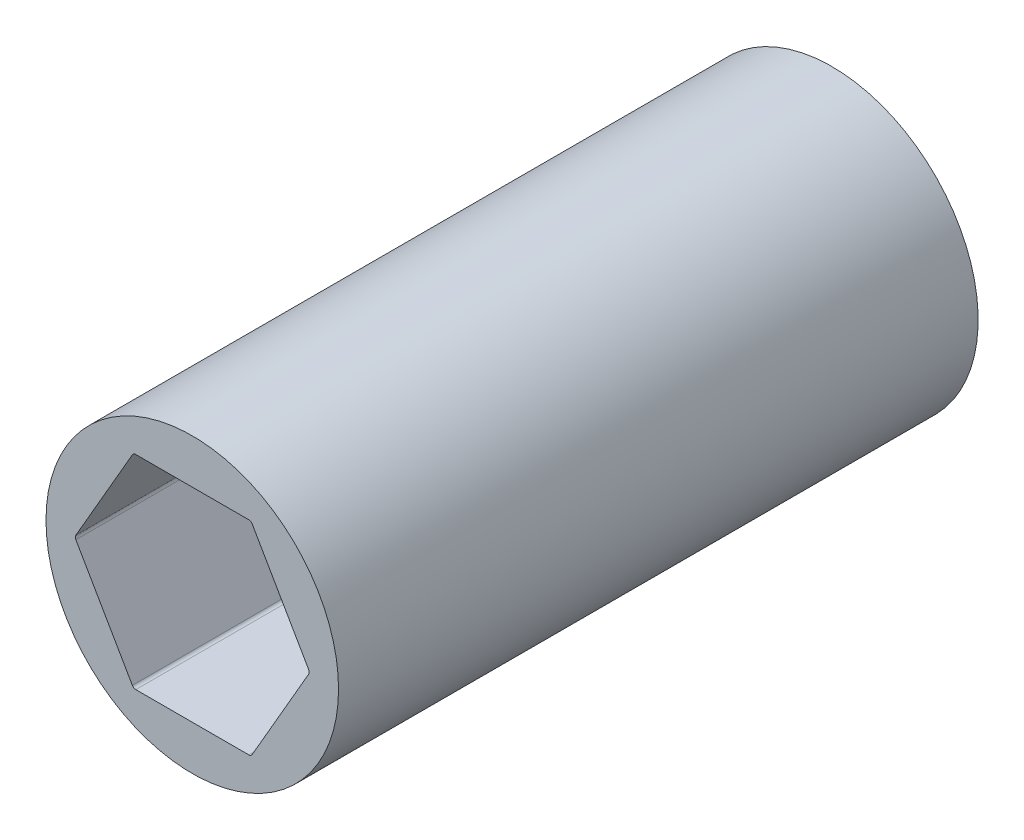
ISO-10303-21;
HEADER;
FILE_DESCRIPTION(('STEP AP214'),'2;1');
FILE_NAME('part.step','',(''),(''),'','','');
FILE_SCHEMA(('AUTOMOTIVE_DESIGN { 1 0 10303 214 1 1 1 1 }'));
ENDSEC;
DATA;
#1=APPLICATION_CONTEXT('core data for automotive mechanical design processes');
#2=APPLICATION_PROTOCOL_DEFINITION('international standard','automotive_design',2000,#1);
#3=PRODUCT_CONTEXT('',#1,'mechanical');
#4=PRODUCT('Part','Part','',(#3));
#5=PRODUCT_RELATED_PRODUCT_CATEGORY('part','',(#4));
#6=PRODUCT_DEFINITION_FORMATION('','',#4);
#7=PRODUCT_DEFINITION_CONTEXT('part definition',#1,'design');
#8=PRODUCT_DEFINITION('design','',#6,#7);
#9=PRODUCT_DEFINITION_SHAPE('','',#8);
#10=(LENGTH_UNIT() NAMED_UNIT(*) SI_UNIT(.MILLI.,.METRE.));
#11=(NAMED_UNIT(*) PLANE_ANGLE_UNIT() SI_UNIT($,.RADIAN.));
#12=(NAMED_UNIT(*) SI_UNIT($,.STERADIAN.) SOLID_ANGLE_UNIT());
#13=UNCERTAINTY_MEASURE_WITH_UNIT(LENGTH_MEASURE(1.E-05),#10,'distance_accuracy_value','');
#14=(GEOMETRIC_REPRESENTATION_CONTEXT(3) GLOBAL_UNCERTAINTY_ASSIGNED_CONTEXT((#13)) GLOBAL_UNIT_ASSIGNED_CONTEXT((#10,
#11,#12)) REPRESENTATION_CONTEXT('',''));
#15=CARTESIAN_POINT('',(0.,0.,0.));
#16=DIRECTION('',(0.,0.,1.));
#17=DIRECTION('',(1.,0.,0.));
#18=AXIS2_PLACEMENT_3D('',#15,#16,#17);
#19=CARTESIAN_POINT('',(7.25902493452117,0.,30.48));
#20=DIRECTION('',(0.,0.,1.));
#21=DIRECTION('',(1.,0.,0.));
#22=AXIS2_PLACEMENT_3D('',#19,#20,#21);
#23=CYLINDRICAL_SURFACE('',#22,0.254);
#24=DIRECTION('',(0.,0.,1.));
#25=VECTOR('',#24,1.);
#26=CARTESIAN_POINT('',(7.47899538708242,0.127,30.48));
#27=LINE('',#26,#25);
#28=CARTESIAN_POINT('',(7.47899538708242,0.127,-10.61466));
#29=VERTEX_POINT('',#28);
#30=CARTESIAN_POINT('',(7.47899538708242,0.127,30.48));
#31=VERTEX_POINT('',#30);
#32=EDGE_CURVE('E233',#29,#31,#27,.T.);
#33=ORIENTED_EDGE('',*,*,#32,.F.);
#34=CARTESIAN_POINT('',(7.25902493452117,0.,-10.61466));
#35=DIRECTION('',(0.,0.,-1.));
#36=DIRECTION('',(-1.,0.,0.));
#37=AXIS2_PLACEMENT_3D('',#34,#35,#36);
#38=CIRCLE('',#37,0.254000000000002);
#39=CARTESIAN_POINT('',(7.47899538708242,-0.127,-10.61466));
#40=VERTEX_POINT('',#39);
#41=EDGE_CURVE('E329',#29,#40,#38,.T.);
#42=ORIENTED_EDGE('',*,*,#41,.T.);
#43=DIRECTION('',(0.,0.,-1.));
#44=VECTOR('',#43,1.);
#45=CARTESIAN_POINT('',(7.47899538708242,-0.127,0.));
#46=LINE('',#45,#44);
#47=CARTESIAN_POINT('',(7.47899538708242,-0.127000000000001,30.48));
#48=VERTEX_POINT('',#47);
#49=EDGE_CURVE('E196',#48,#40,#46,.T.);
#50=ORIENTED_EDGE('',*,*,#49,.F.);
#51=CARTESIAN_POINT('',(7.25902493452117,0.,30.48));
#52=DIRECTION('',(0.,0.,-1.));
#53=DIRECTION('',(1.,0.,0.));
#54=AXIS2_PLACEMENT_3D('',#51,#52,#53);
#55=CIRCLE('',#54,0.254);
#56=CARTESIAN_POINT('',(7.51302493452117,0.,30.48));
#57=VERTEX_POINT('',#56);
#58=EDGE_CURVE('E164',#57,#48,#55,.T.);
#59=ORIENTED_EDGE('',*,*,#58,.F.);
#60=DIRECTION('',(0.,0.,1.));
#61=VECTOR('',#60,1.);
#62=CARTESIAN_POINT('',(7.51302493452117,0.,30.48));
#63=LINE('',#62,#61);
#64=CARTESIAN_POINT('',(7.51302493452117,0.,0.));
#65=VERTEX_POINT('',#64);
#66=EDGE_CURVE('E11',#65,#57,#63,.T.);
#67=ORIENTED_EDGE('',*,*,#66,.F.);
#68=ORIENTED_EDGE('',*,*,#66,.T.);
#69=CARTESIAN_POINT('',(7.25902493452117,0.,30.48));
#70=DIRECTION('',(0.,0.,-1.));
#71=DIRECTION('',(1.,0.,0.));
#72=AXIS2_PLACEMENT_3D('',#69,#70,#71);
#73=CIRCLE('',#72,0.254);
#74=EDGE_CURVE('E221',#31,#57,#73,.T.);
#75=ORIENTED_EDGE('',*,*,#74,.F.);
#76=EDGE_LOOP('',(#33,#42,#50,#59,#67,#68,#75));
#77=FACE_BOUND('',#76,.T.);
#78=ADVANCED_FACE('F43',(#77),#23,.F.);
#79=CARTESIAN_POINT('',(0.,0.,30.48));
#80=DIRECTION('',(0.,0.,-1.));
#81=DIRECTION('',(-1.,0.,0.));
#82=AXIS2_PLACEMENT_3D('',#79,#80,#81);
#83=CYLINDRICAL_SURFACE('',#82,9.398);
#84=CARTESIAN_POINT('',(0.,0.,30.48));
#85=DIRECTION('',(0.,0.,1.));
#86=DIRECTION('',(1.,0.,0.));
#87=AXIS2_PLACEMENT_3D('',#84,#85,#86);
#88=CIRCLE('',#87,9.398);
#89=CARTESIAN_POINT('',(9.398,0.,30.48));
#90=VERTEX_POINT('',#89);
#91=CARTESIAN_POINT('',(-9.398,0.,30.48));
#92=VERTEX_POINT('',#91);
#93=EDGE_CURVE('E224',#90,#92,#88,.T.);
#94=ORIENTED_EDGE('',*,*,#93,.F.);
#95=DIRECTION('',(0.,0.,-1.));
#96=VECTOR('',#95,1.);
#97=CARTESIAN_POINT('',(9.398,0.,30.48));
#98=LINE('',#97,#96);
#99=CARTESIAN_POINT('',(9.398,0.,0.));
#100=VERTEX_POINT('',#99);
#101=EDGE_CURVE('E54',#90,#100,#98,.T.);
#102=ORIENTED_EDGE('',*,*,#101,.T.);
#103=ORIENTED_EDGE('',*,*,#101,.F.);
#104=CARTESIAN_POINT('',(0.,0.,30.48));
#105=DIRECTION('',(0.,0.,1.));
#106=DIRECTION('',(1.,0.,0.));
#107=AXIS2_PLACEMENT_3D('',#104,#105,#106);
#108=CIRCLE('',#107,9.398);
#109=EDGE_CURVE('E240',#92,#90,#108,.T.);
#110=ORIENTED_EDGE('',*,*,#109,.F.);
#111=DIRECTION('',(0.,0.,-1.));
#112=VECTOR('',#111,1.);
#113=CARTESIAN_POINT('',(-9.398,0.,30.48));
#114=LINE('',#113,#112);
#115=CARTESIAN_POINT('',(-9.398,0.,0.));
#116=VERTEX_POINT('',#115);
#117=EDGE_CURVE('E190',#92,#116,#114,.T.);
#118=ORIENTED_EDGE('',*,*,#117,.T.);
#119=ORIENTED_EDGE('',*,*,#117,.F.);
#120=EDGE_LOOP('',(#94,#102,#103,#110,#118,#119));
#121=FACE_BOUND('',#120,.T.);
#122=CARTESIAN_POINT('',(0.,0.,-10.61466));
#123=DIRECTION('',(0.,0.,-1.));
#124=DIRECTION('',(-1.,0.,0.));
#125=AXIS2_PLACEMENT_3D('',#122,#123,#124);
#126=CIRCLE('',#125,9.398);
#127=CARTESIAN_POINT('',(-9.398,0.,-10.61466));
#128=VERTEX_POINT('',#127);
#129=EDGE_CURVE('E172',#128,#128,#126,.T.);
#130=ORIENTED_EDGE('',*,*,#129,.F.);
#131=EDGE_LOOP('',(#130));
#132=FACE_BOUND('',#131,.T.);
#133=ADVANCED_FACE('F256',(#121,#132),#83,.T.);
#134=CARTESIAN_POINT('',(0.,0.,30.48));
#135=DIRECTION('',(0.,0.,1.));
#136=DIRECTION('',(1.,0.,0.));
#137=AXIS2_PLACEMENT_3D('',#134,#135,#136);
#138=PLANE('',#137);
#139=ORIENTED_EDGE('',*,*,#109,.T.);
#140=ORIENTED_EDGE('',*,*,#93,.T.);
#141=EDGE_LOOP('',(#139,#140));
#142=FACE_BOUND('',#141,.T.);
#143=DIRECTION('',(-0.5,0.866025403784438,0.));
#144=VECTOR('',#143,1.);
#145=CARTESIAN_POINT('',(7.5523188712695,0.,30.48));
#146=LINE('',#145,#144);
#147=CARTESIAN_POINT('',(3.84948291982183,6.4135,30.48));
#148=VERTEX_POINT('',#147);
#149=EDGE_CURVE('E200',#31,#148,#146,.T.);
#150=ORIENTED_EDGE('',*,*,#149,.F.);
#151=ORIENTED_EDGE('',*,*,#74,.T.);
#152=ORIENTED_EDGE('',*,*,#58,.T.);
#153=DIRECTION('',(0.5,0.866025403784439,0.));
#154=VECTOR('',#153,1.);
#155=CARTESIAN_POINT('',(3.77615943563475,-6.5405,30.48));
#156=LINE('',#155,#154);
#157=CARTESIAN_POINT('',(3.84948291982184,-6.4135,30.48));
#158=VERTEX_POINT('',#157);
#159=EDGE_CURVE('E159',#158,#48,#156,.T.);
#160=ORIENTED_EDGE('',*,*,#159,.F.);
#161=CARTESIAN_POINT('',(3.62951246726059,-6.2865,30.48));
#162=DIRECTION('',(0.,0.,-1.));
#163=DIRECTION('',(1.,0.,0.));
#164=AXIS2_PLACEMENT_3D('',#161,#162,#163);
#165=CIRCLE('',#164,0.254);
#166=CARTESIAN_POINT('',(3.62951246726058,-6.5405,30.48));
#167=VERTEX_POINT('',#166);
#168=EDGE_CURVE('E155',#158,#167,#165,.T.);
#169=ORIENTED_EDGE('',*,*,#168,.T.);
#170=DIRECTION('',(1.,0.,0.));
#171=VECTOR('',#170,1.);
#172=CARTESIAN_POINT('',(-3.77615943563474,-6.5405,30.48));
#173=LINE('',#172,#171);
#174=CARTESIAN_POINT('',(-3.62951246726058,-6.5405,30.48));
#175=VERTEX_POINT('',#174);
#176=EDGE_CURVE('E140',#175,#167,#173,.T.);
#177=ORIENTED_EDGE('',*,*,#176,.F.);
#178=CARTESIAN_POINT('',(-3.62951246726058,-6.2865,30.48));
#179=DIRECTION('',(0.,0.,-1.));
#180=DIRECTION('',(1.,0.,0.));
#181=AXIS2_PLACEMENT_3D('',#178,#179,#180);
#182=CIRCLE('',#181,0.254);
#183=CARTESIAN_POINT('',(-3.84948291982183,-6.4135,30.48));
#184=VERTEX_POINT('',#183);
#185=EDGE_CURVE('E165',#175,#184,#182,.T.);
#186=ORIENTED_EDGE('',*,*,#185,.T.);
#187=DIRECTION('',(0.5,-0.866025403784439,0.));
#188=VECTOR('',#187,1.);
#189=CARTESIAN_POINT('',(-7.5523188712695,0.,30.48));
#190=LINE('',#189,#188);
#191=CARTESIAN_POINT('',(-7.47899538708241,-0.126999999999999,30.48));
#192=VERTEX_POINT('',#191);
#193=EDGE_CURVE('E215',#192,#184,#190,.T.);
#194=ORIENTED_EDGE('',*,*,#193,.F.);
#195=CARTESIAN_POINT('',(-7.25902493452117,0.,30.48));
#196=DIRECTION('',(0.,0.,-1.));
#197=DIRECTION('',(1.,0.,0.));
#198=AXIS2_PLACEMENT_3D('',#195,#196,#197);
#199=CIRCLE('',#198,0.254);
#200=CARTESIAN_POINT('',(-7.47899538708241,0.127000000000003,30.48));
#201=VERTEX_POINT('',#200);
#202=EDGE_CURVE('E207',#192,#201,#199,.T.);
#203=ORIENTED_EDGE('',*,*,#202,.T.);
#204=DIRECTION('',(-0.5,-0.866025403784439,0.));
#205=VECTOR('',#204,1.);
#206=CARTESIAN_POINT('',(-3.77615943563474,6.5405,30.48));
#207=LINE('',#206,#205);
#208=CARTESIAN_POINT('',(-3.84948291982183,6.4135,30.48));
#209=VERTEX_POINT('',#208);
#210=EDGE_CURVE('E123',#209,#201,#207,.T.);
#211=ORIENTED_EDGE('',*,*,#210,.F.);
#212=CARTESIAN_POINT('',(-3.62951246726058,6.2865,30.48));
#213=DIRECTION('',(0.,0.,-1.));
#214=DIRECTION('',(1.,0.,0.));
#215=AXIS2_PLACEMENT_3D('',#212,#213,#214);
#216=CIRCLE('',#215,0.254);
#217=CARTESIAN_POINT('',(-3.62951246726058,6.5405,30.48));
#218=VERTEX_POINT('',#217);
#219=EDGE_CURVE('E195',#209,#218,#216,.T.);
#220=ORIENTED_EDGE('',*,*,#219,.T.);
#221=DIRECTION('',(-1.,0.,0.));
#222=VECTOR('',#221,1.);
#223=CARTESIAN_POINT('',(3.77615943563475,6.5405,30.48));
#224=LINE('',#223,#222);
#225=CARTESIAN_POINT('',(3.62951246726058,6.5405,30.48));
#226=VERTEX_POINT('',#225);
#227=EDGE_CURVE('E111',#226,#218,#224,.T.);
#228=ORIENTED_EDGE('',*,*,#227,.F.);
#229=CARTESIAN_POINT('',(3.62951246726058,6.2865,30.48));
#230=DIRECTION('',(0.,0.,-1.));
#231=DIRECTION('',(1.,0.,0.));
#232=AXIS2_PLACEMENT_3D('',#229,#230,#231);
#233=CIRCLE('',#232,0.254);
#234=EDGE_CURVE('E191',#226,#148,#233,.T.);
#235=ORIENTED_EDGE('',*,*,#234,.T.);
#236=EDGE_LOOP('',(#150,#151,#152,#160,#169,#177,#186,#194,#203,#211,#220,#228,#235));
#237=FACE_BOUND('',#236,.T.);
#238=ADVANCED_FACE('F157',(#142,#237),#138,.T.);
#239=CARTESIAN_POINT('',(3.77615943563475,-6.5405,30.48));
#240=DIRECTION('',(-0.866025403784439,0.5,0.));
#241=DIRECTION('',(0.,0.,1.));
#242=AXIS2_PLACEMENT_3D('',#239,#240,#241);
#243=PLANE('',#242);
#244=ORIENTED_EDGE('',*,*,#49,.T.);
#245=DIRECTION('',(-0.5,-0.866025403784438,0.));
#246=VECTOR('',#245,1.);
#247=CARTESIAN_POINT('',(3.84948291982184,-6.4135,-10.61466));
#248=LINE('',#247,#246);
#249=CARTESIAN_POINT('',(3.84948291982184,-6.4135,-10.61466));
#250=VERTEX_POINT('',#249);
#251=EDGE_CURVE('E334',#40,#250,#248,.T.);
#252=ORIENTED_EDGE('',*,*,#251,.T.);
#253=DIRECTION('',(0.,0.,1.));
#254=VECTOR('',#253,1.);
#255=CARTESIAN_POINT('',(3.84948291982184,-6.4135,30.48));
#256=LINE('',#255,#254);
#257=EDGE_CURVE('E187',#250,#158,#256,.T.);
#258=ORIENTED_EDGE('',*,*,#257,.T.);
#259=ORIENTED_EDGE('',*,*,#159,.T.);
#260=EDGE_LOOP('',(#244,#252,#258,#259));
#261=FACE_BOUND('',#260,.T.);
#262=ADVANCED_FACE('F385',(#261),#243,.T.);
#263=CARTESIAN_POINT('',(7.5523188712695,0.,30.48));
#264=DIRECTION('',(-0.866025403784438,-0.5,0.));
#265=DIRECTION('',(-0.5,0.866025403784438,0.));
#266=AXIS2_PLACEMENT_3D('',#263,#264,#265);
#267=PLANE('',#266);
#268=ORIENTED_EDGE('',*,*,#149,.T.);
#269=DIRECTION('',(0.,0.,-1.));
#270=VECTOR('',#269,1.);
#271=CARTESIAN_POINT('',(3.84948291982183,6.4135,0.));
#272=LINE('',#271,#270);
#273=CARTESIAN_POINT('',(3.84948291982184,6.41350000000001,-10.61466));
#274=VERTEX_POINT('',#273);
#275=EDGE_CURVE('E210',#148,#274,#272,.T.);
#276=ORIENTED_EDGE('',*,*,#275,.T.);
#277=DIRECTION('',(0.499999999999999,-0.866025403784439,0.));
#278=VECTOR('',#277,1.);
#279=CARTESIAN_POINT('',(7.47899538708242,0.127,-10.61466));
#280=LINE('',#279,#278);
#281=EDGE_CURVE('E281',#274,#29,#280,.T.);
#282=ORIENTED_EDGE('',*,*,#281,.T.);
#283=ORIENTED_EDGE('',*,*,#32,.T.);
#284=EDGE_LOOP('',(#268,#276,#282,#283));
#285=FACE_BOUND('',#284,.T.);
#286=ADVANCED_FACE('F278',(#285),#267,.T.);
#287=CARTESIAN_POINT('',(3.77615943563475,6.5405,30.48));
#288=DIRECTION('',(0.,-1.,0.));
#289=DIRECTION('',(0.,0.,-1.));
#290=AXIS2_PLACEMENT_3D('',#287,#288,#289);
#291=PLANE('',#290);
#292=DIRECTION('',(0.,0.,-1.));
#293=VECTOR('',#292,1.);
#294=CARTESIAN_POINT('',(-3.62951246726058,6.5405,0.));
#295=LINE('',#294,#293);
#296=CARTESIAN_POINT('',(-3.62951246726058,6.5405,-10.61466));
#297=VERTEX_POINT('',#296);
#298=EDGE_CURVE('E204',#218,#297,#295,.T.);
#299=ORIENTED_EDGE('',*,*,#298,.T.);
#300=DIRECTION('',(1.,0.,0.));
#301=VECTOR('',#300,1.);
#302=CARTESIAN_POINT('',(3.62951246726058,6.5405,-10.61466));
#303=LINE('',#302,#301);
#304=CARTESIAN_POINT('',(3.62951246726058,6.5405,-10.61466));
#305=VERTEX_POINT('',#304);
#306=EDGE_CURVE('E177',#297,#305,#303,.T.);
#307=ORIENTED_EDGE('',*,*,#306,.T.);
#308=DIRECTION('',(0.,0.,1.));
#309=VECTOR('',#308,1.);
#310=CARTESIAN_POINT('',(3.62951246726058,6.5405,30.48));
#311=LINE('',#310,#309);
#312=EDGE_CURVE('E203',#305,#226,#311,.T.);
#313=ORIENTED_EDGE('',*,*,#312,.T.);
#314=ORIENTED_EDGE('',*,*,#227,.T.);
#315=EDGE_LOOP('',(#299,#307,#313,#314));
#316=FACE_BOUND('',#315,.T.);
#317=ADVANCED_FACE('F317',(#316),#291,.T.);
#318=CARTESIAN_POINT('',(-3.77615943563474,6.5405,30.48));
#319=DIRECTION('',(0.866025403784439,-0.5,0.));
#320=DIRECTION('',(0.,0.,-1.));
#321=AXIS2_PLACEMENT_3D('',#318,#319,#320);
#322=PLANE('',#321);
#323=DIRECTION('',(0.,0.,-1.));
#324=VECTOR('',#323,1.);
#325=CARTESIAN_POINT('',(-7.47899538708241,0.127000000000002,0.));
#326=LINE('',#325,#324);
#327=CARTESIAN_POINT('',(-7.47899538708241,0.127000000000003,-10.61466));
#328=VERTEX_POINT('',#327);
#329=EDGE_CURVE('E214',#201,#328,#326,.T.);
#330=ORIENTED_EDGE('',*,*,#329,.T.);
#331=DIRECTION('',(0.5,0.866025403784439,0.));
#332=VECTOR('',#331,1.);
#333=CARTESIAN_POINT('',(-3.84948291982183,6.4135,-10.61466));
#334=LINE('',#333,#332);
#335=CARTESIAN_POINT('',(-3.84948291982183,6.4135,-10.61466));
#336=VERTEX_POINT('',#335);
#337=EDGE_CURVE('E355',#328,#336,#334,.T.);
#338=ORIENTED_EDGE('',*,*,#337,.T.);
#339=DIRECTION('',(0.,0.,1.));
#340=VECTOR('',#339,1.);
#341=CARTESIAN_POINT('',(-3.84948291982183,6.4135,30.48));
#342=LINE('',#341,#340);
#343=EDGE_CURVE('E213',#336,#209,#342,.T.);
#344=ORIENTED_EDGE('',*,*,#343,.T.);
#345=ORIENTED_EDGE('',*,*,#210,.T.);
#346=EDGE_LOOP('',(#330,#338,#344,#345));
#347=FACE_BOUND('',#346,.T.);
#348=ADVANCED_FACE('F368',(#347),#322,.T.);
#349=CARTESIAN_POINT('',(-7.5523188712695,0.,30.48));
#350=DIRECTION('',(0.866025403784439,0.5,0.));
#351=DIRECTION('',(0.,0.,-1.));
#352=AXIS2_PLACEMENT_3D('',#349,#350,#351);
#353=PLANE('',#352);
#354=ORIENTED_EDGE('',*,*,#193,.T.);
#355=DIRECTION('',(0.,0.,-1.));
#356=VECTOR('',#355,1.);
#357=CARTESIAN_POINT('',(-3.84948291982183,-6.4135,0.));
#358=LINE('',#357,#356);
#359=CARTESIAN_POINT('',(-3.84948291982183,-6.4135,-10.61466));
#360=VERTEX_POINT('',#359);
#361=EDGE_CURVE('E185',#184,#360,#358,.T.);
#362=ORIENTED_EDGE('',*,*,#361,.T.);
#363=DIRECTION('',(-0.5,0.866025403784439,0.));
#364=VECTOR('',#363,1.);
#365=CARTESIAN_POINT('',(-7.47899538708241,-0.126999999999999,-10.61466));
#366=LINE('',#365,#364);
#367=CARTESIAN_POINT('',(-7.47899538708241,-0.126999999999999,-10.61466));
#368=VERTEX_POINT('',#367);
#369=EDGE_CURVE('E347',#360,#368,#366,.T.);
#370=ORIENTED_EDGE('',*,*,#369,.T.);
#371=DIRECTION('',(0.,0.,1.));
#372=VECTOR('',#371,1.);
#373=CARTESIAN_POINT('',(-7.47899538708241,-0.126999999999998,30.48));
#374=LINE('',#373,#372);
#375=EDGE_CURVE('E182',#368,#192,#374,.T.);
#376=ORIENTED_EDGE('',*,*,#375,.T.);
#377=EDGE_LOOP('',(#354,#362,#370,#376));
#378=FACE_BOUND('',#377,.T.);
#379=ADVANCED_FACE('F379',(#378),#353,.T.);
#380=CARTESIAN_POINT('',(-3.77615943563474,-6.5405,30.48));
#381=DIRECTION('',(0.,1.,0.));
#382=DIRECTION('',(1.,0.,0.));
#383=AXIS2_PLACEMENT_3D('',#380,#381,#382);
#384=PLANE('',#383);
#385=DIRECTION('',(0.,0.,-1.));
#386=VECTOR('',#385,1.);
#387=CARTESIAN_POINT('',(3.62951246726059,-6.5405,0.));
#388=LINE('',#387,#386);
#389=CARTESIAN_POINT('',(3.62951246726058,-6.5405,-10.61466));
#390=VERTEX_POINT('',#389);
#391=EDGE_CURVE('E146',#167,#390,#388,.T.);
#392=ORIENTED_EDGE('',*,*,#391,.T.);
#393=DIRECTION('',(-1.,0.,0.));
#394=VECTOR('',#393,1.);
#395=CARTESIAN_POINT('',(-3.62951246726058,-6.5405,-10.61466));
#396=LINE('',#395,#394);
#397=CARTESIAN_POINT('',(-3.62951246726058,-6.5405,-10.61466));
#398=VERTEX_POINT('',#397);
#399=EDGE_CURVE('E340',#390,#398,#396,.T.);
#400=ORIENTED_EDGE('',*,*,#399,.T.);
#401=DIRECTION('',(0.,0.,1.));
#402=VECTOR('',#401,1.);
#403=CARTESIAN_POINT('',(-3.62951246726058,-6.5405,30.48));
#404=LINE('',#403,#402);
#405=EDGE_CURVE('E149',#398,#175,#404,.T.);
#406=ORIENTED_EDGE('',*,*,#405,.T.);
#407=ORIENTED_EDGE('',*,*,#176,.T.);
#408=EDGE_LOOP('',(#392,#400,#406,#407));
#409=FACE_BOUND('',#408,.T.);
#410=ADVANCED_FACE('F142',(#409),#384,.T.);
#411=CARTESIAN_POINT('',(3.62951246726058,6.2865,30.48));
#412=DIRECTION('',(0.,0.,1.));
#413=DIRECTION('',(1.,0.,0.));
#414=AXIS2_PLACEMENT_3D('',#411,#412,#413);
#415=CYLINDRICAL_SURFACE('',#414,0.254);
#416=ORIENTED_EDGE('',*,*,#234,.F.);
#417=ORIENTED_EDGE('',*,*,#312,.F.);
#418=CARTESIAN_POINT('',(3.62951246726058,6.2865,-10.61466));
#419=DIRECTION('',(0.,0.,-1.));
#420=DIRECTION('',(-1.,0.,0.));
#421=AXIS2_PLACEMENT_3D('',#418,#419,#420);
#422=CIRCLE('',#421,0.254000000000009);
#423=EDGE_CURVE('E294',#305,#274,#422,.T.);
#424=ORIENTED_EDGE('',*,*,#423,.T.);
#425=ORIENTED_EDGE('',*,*,#275,.F.);
#426=EDGE_LOOP('',(#416,#417,#424,#425));
#427=FACE_BOUND('',#426,.T.);
#428=ADVANCED_FACE('F291',(#427),#415,.F.);
#429=CARTESIAN_POINT('',(-3.62951246726058,6.2865,30.48));
#430=DIRECTION('',(0.,0.,1.));
#431=DIRECTION('',(1.,0.,0.));
#432=AXIS2_PLACEMENT_3D('',#429,#430,#431);
#433=CYLINDRICAL_SURFACE('',#432,0.254);
#434=ORIENTED_EDGE('',*,*,#219,.F.);
#435=ORIENTED_EDGE('',*,*,#343,.F.);
#436=CARTESIAN_POINT('',(-3.62951246726058,6.2865,-10.61466));
#437=DIRECTION('',(0.,0.,-1.));
#438=DIRECTION('',(-1.,0.,0.));
#439=AXIS2_PLACEMENT_3D('',#436,#437,#438);
#440=CIRCLE('',#439,0.254000000000001);
#441=EDGE_CURVE('E323',#336,#297,#440,.T.);
#442=ORIENTED_EDGE('',*,*,#441,.T.);
#443=ORIENTED_EDGE('',*,*,#298,.F.);
#444=EDGE_LOOP('',(#434,#435,#442,#443));
#445=FACE_BOUND('',#444,.T.);
#446=ADVANCED_FACE('F371',(#445),#433,.F.);
#447=CARTESIAN_POINT('',(-3.62951246726058,-6.2865,30.48));
#448=DIRECTION('',(0.,0.,1.));
#449=DIRECTION('',(1.,0.,0.));
#450=AXIS2_PLACEMENT_3D('',#447,#448,#449);
#451=CYLINDRICAL_SURFACE('',#450,0.254);
#452=ORIENTED_EDGE('',*,*,#185,.F.);
#453=ORIENTED_EDGE('',*,*,#405,.F.);
#454=CARTESIAN_POINT('',(-3.62951246726058,-6.2865,-10.61466));
#455=DIRECTION('',(0.,0.,-1.));
#456=DIRECTION('',(-1.,0.,0.));
#457=AXIS2_PLACEMENT_3D('',#454,#455,#456);
#458=CIRCLE('',#457,0.254);
#459=EDGE_CURVE('E343',#398,#360,#458,.T.);
#460=ORIENTED_EDGE('',*,*,#459,.T.);
#461=ORIENTED_EDGE('',*,*,#361,.F.);
#462=EDGE_LOOP('',(#452,#453,#460,#461));
#463=FACE_BOUND('',#462,.T.);
#464=ADVANCED_FACE('F382',(#463),#451,.F.);
#465=CARTESIAN_POINT('',(3.62951246726059,-6.2865,30.48));
#466=DIRECTION('',(0.,0.,1.));
#467=DIRECTION('',(1.,0.,0.));
#468=AXIS2_PLACEMENT_3D('',#465,#466,#467);
#469=CYLINDRICAL_SURFACE('',#468,0.254);
#470=ORIENTED_EDGE('',*,*,#168,.F.);
#471=ORIENTED_EDGE('',*,*,#257,.F.);
#472=CARTESIAN_POINT('',(3.62951246726059,-6.2865,-10.61466));
#473=DIRECTION('',(0.,0.,-1.));
#474=DIRECTION('',(-1.,0.,0.));
#475=AXIS2_PLACEMENT_3D('',#472,#473,#474);
#476=CIRCLE('',#475,0.253999999999998);
#477=EDGE_CURVE('E169',#250,#390,#476,.T.);
#478=ORIENTED_EDGE('',*,*,#477,.T.);
#479=ORIENTED_EDGE('',*,*,#391,.F.);
#480=EDGE_LOOP('',(#470,#471,#478,#479));
#481=FACE_BOUND('',#480,.T.);
#482=ADVANCED_FACE('F167',(#481),#469,.F.);
#483=CARTESIAN_POINT('',(-7.25902493452117,0.,30.48));
#484=DIRECTION('',(0.,0.,1.));
#485=DIRECTION('',(1.,0.,0.));
#486=AXIS2_PLACEMENT_3D('',#483,#484,#485);
#487=CYLINDRICAL_SURFACE('',#486,0.254);
#488=ORIENTED_EDGE('',*,*,#202,.F.);
#489=ORIENTED_EDGE('',*,*,#375,.F.);
#490=CARTESIAN_POINT('',(-7.25902493452117,0.,-10.61466));
#491=DIRECTION('',(0.,0.,-1.));
#492=DIRECTION('',(-1.,0.,0.));
#493=AXIS2_PLACEMENT_3D('',#490,#491,#492);
#494=CIRCLE('',#493,0.253999999999994);
#495=EDGE_CURVE('E351',#368,#328,#494,.T.);
#496=ORIENTED_EDGE('',*,*,#495,.T.);
#497=ORIENTED_EDGE('',*,*,#329,.F.);
#498=EDGE_LOOP('',(#488,#489,#496,#497));
#499=FACE_BOUND('',#498,.T.);
#500=ADVANCED_FACE('F45',(#499),#487,.F.);
#501=CARTESIAN_POINT('',(0.,0.,-10.61466));
#502=DIRECTION('',(0.,0.,-1.));
#503=DIRECTION('',(-1.,0.,0.));
#504=AXIS2_PLACEMENT_3D('',#501,#502,#503);
#505=PLANE('',#504);
#506=ORIENTED_EDGE('',*,*,#129,.T.);
#507=EDGE_LOOP('',(#506));
#508=FACE_BOUND('',#507,.T.);
#509=ORIENTED_EDGE('',*,*,#281,.F.);
#510=ORIENTED_EDGE('',*,*,#423,.F.);
#511=ORIENTED_EDGE('',*,*,#306,.F.);
#512=ORIENTED_EDGE('',*,*,#441,.F.);
#513=ORIENTED_EDGE('',*,*,#337,.F.);
#514=ORIENTED_EDGE('',*,*,#495,.F.);
#515=ORIENTED_EDGE('',*,*,#369,.F.);
#516=ORIENTED_EDGE('',*,*,#459,.F.);
#517=ORIENTED_EDGE('',*,*,#399,.F.);
#518=ORIENTED_EDGE('',*,*,#477,.F.);
#519=ORIENTED_EDGE('',*,*,#251,.F.);
#520=ORIENTED_EDGE('',*,*,#41,.F.);
#521=EDGE_LOOP('',(#509,#510,#511,#512,#513,#514,#515,#516,#517,#518,#519,#520));
#522=FACE_BOUND('',#521,.T.);
#523=ADVANCED_FACE('F325',(#508,#522),#505,.T.);
#524=CLOSED_SHELL('',(#78,#133,#238,#262,#286,#317,#348,#379,#410,#428,#446,#464,#482,#500,#523));
#525=MANIFOLD_SOLID_BREP('B2',#524);
#526=ADVANCED_BREP_SHAPE_REPRESENTATION('',(#18,#525),#14);
#527=SHAPE_DEFINITION_REPRESENTATION(#9,#526);
ENDSEC;
END-ISO-10303-21;
